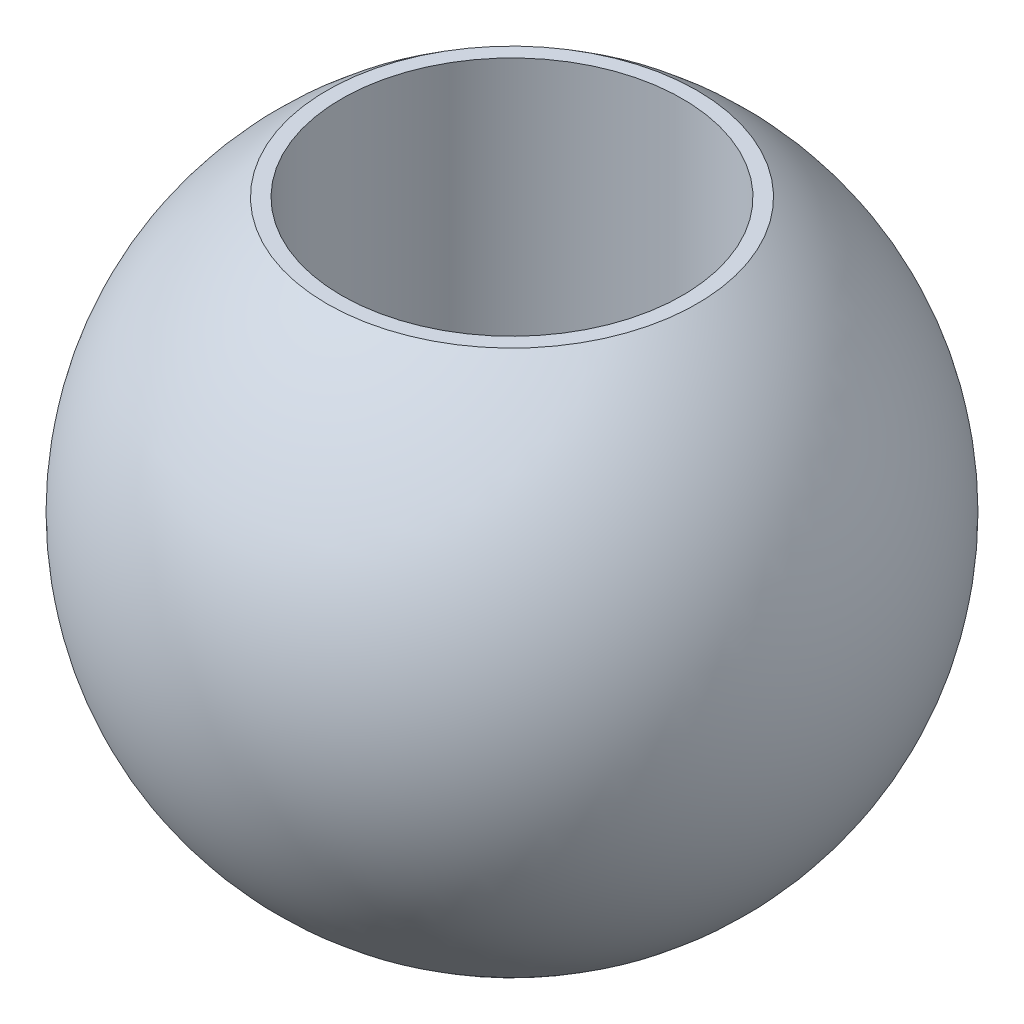
ISO-10303-21;
HEADER;
FILE_DESCRIPTION(('STEP AP214'),'2;1');
FILE_NAME('part.step','',(''),(''),'','','');
FILE_SCHEMA(('AUTOMOTIVE_DESIGN { 1 0 10303 214 1 1 1 1 }'));
ENDSEC;
DATA;
#1=APPLICATION_CONTEXT('core data for automotive mechanical design processes');
#2=APPLICATION_PROTOCOL_DEFINITION('international standard','automotive_design',2000,#1);
#3=PRODUCT_CONTEXT('',#1,'mechanical');
#4=PRODUCT('Part','Part','',(#3));
#5=PRODUCT_RELATED_PRODUCT_CATEGORY('part','',(#4));
#6=PRODUCT_DEFINITION_FORMATION('','',#4);
#7=PRODUCT_DEFINITION_CONTEXT('part definition',#1,'design');
#8=PRODUCT_DEFINITION('design','',#6,#7);
#9=PRODUCT_DEFINITION_SHAPE('','',#8);
#10=(LENGTH_UNIT() NAMED_UNIT(*) SI_UNIT(.MILLI.,.METRE.));
#11=(NAMED_UNIT(*) PLANE_ANGLE_UNIT() SI_UNIT($,.RADIAN.));
#12=(NAMED_UNIT(*) SI_UNIT($,.STERADIAN.) SOLID_ANGLE_UNIT());
#13=UNCERTAINTY_MEASURE_WITH_UNIT(LENGTH_MEASURE(1.E-05),#10,'distance_accuracy_value','');
#14=(GEOMETRIC_REPRESENTATION_CONTEXT(3) GLOBAL_UNCERTAINTY_ASSIGNED_CONTEXT((#13)) GLOBAL_UNIT_ASSIGNED_CONTEXT((#10,
#11,#12)) REPRESENTATION_CONTEXT('',''));
#15=CARTESIAN_POINT('',(0.,0.,0.));
#16=DIRECTION('',(0.,0.,1.));
#17=DIRECTION('',(1.,0.,0.));
#18=AXIS2_PLACEMENT_3D('',#15,#16,#17);
#19=CARTESIAN_POINT('',(2.9,0.,0.));
#20=DIRECTION('',(-1.,0.,0.));
#21=DIRECTION('',(0.,1.,0.));
#22=AXIS2_PLACEMENT_3D('',#19,#20,#21);
#23=SPHERICAL_SURFACE('',#22,2.9);
#24=CARTESIAN_POINT('',(2.9,0.,0.));
#25=DIRECTION('',(0.,-1.,0.));
#26=DIRECTION('',(0.,0.,-1.));
#27=AXIS2_PLACEMENT_3D('',#24,#25,#26);
#28=SPHERICAL_SURFACE('',#27,2.9);
#29=CARTESIAN_POINT('',(2.9,2.4,0.));
#30=DIRECTION('',(0.,-1.,0.));
#31=DIRECTION('',(0.,0.,-1.));
#32=AXIS2_PLACEMENT_3D('',#29,#30,#31);
#33=CIRCLE('',#32,1.62788205960997);
#34=CARTESIAN_POINT('',(2.9,2.4,-1.62788205960997));
#35=VERTEX_POINT('',#34);
#36=EDGE_CURVE('E10',#35,#35,#33,.T.);
#37=ORIENTED_EDGE('',*,*,#36,.T.);
#38=EDGE_LOOP('',(#37));
#39=FACE_BOUND('',#38,.T.);
#40=CARTESIAN_POINT('',(2.9,-2.4,0.));
#41=DIRECTION('',(0.,1.,0.));
#42=DIRECTION('',(0.,0.,1.));
#43=AXIS2_PLACEMENT_3D('',#40,#41,#42);
#44=CIRCLE('',#43,1.62788205960997);
#45=CARTESIAN_POINT('',(2.9,-2.4,1.62788205960997));
#46=VERTEX_POINT('',#45);
#47=EDGE_CURVE('E38',#46,#46,#44,.T.);
#48=ORIENTED_EDGE('',*,*,#47,.T.);
#49=EDGE_LOOP('',(#48));
#50=FACE_BOUND('',#49,.T.);
#51=ADVANCED_FACE('F32',(#39,#50),#28,.T.);
#52=CARTESIAN_POINT('',(1.27211794039003,-2.4,-5.));
#53=DIRECTION('',(0.,1.,0.));
#54=DIRECTION('',(0.,0.,1.));
#55=AXIS2_PLACEMENT_3D('',#52,#53,#54);
#56=PLANE('',#55);
#57=CARTESIAN_POINT('',(2.9,-2.4,0.));
#58=DIRECTION('',(0.,1.,0.));
#59=DIRECTION('',(0.,0.,1.));
#60=AXIS2_PLACEMENT_3D('',#57,#58,#59);
#61=CIRCLE('',#60,1.5);
#62=CARTESIAN_POINT('',(2.9,-2.4,1.5));
#63=VERTEX_POINT('',#62);
#64=EDGE_CURVE('E42',#63,#63,#61,.T.);
#65=ORIENTED_EDGE('',*,*,#64,.T.);
#66=EDGE_LOOP('',(#65));
#67=FACE_BOUND('',#66,.T.);
#68=ORIENTED_EDGE('',*,*,#47,.F.);
#69=EDGE_LOOP('',(#68));
#70=FACE_BOUND('',#69,.T.);
#71=ADVANCED_FACE('F57',(#67,#70),#56,.F.);
#72=CARTESIAN_POINT('',(1.27211794039003,2.4,-5.));
#73=DIRECTION('',(0.,-1.,0.));
#74=DIRECTION('',(0.,0.,-1.));
#75=AXIS2_PLACEMENT_3D('',#72,#73,#74);
#76=PLANE('',#75);
#77=CARTESIAN_POINT('',(2.9,2.4,0.));
#78=DIRECTION('',(0.,1.,0.));
#79=DIRECTION('',(0.,0.,1.));
#80=AXIS2_PLACEMENT_3D('',#77,#78,#79);
#81=CIRCLE('',#80,1.5);
#82=CARTESIAN_POINT('',(2.9,2.4,1.5));
#83=VERTEX_POINT('',#82);
#84=EDGE_CURVE('E46',#83,#83,#81,.T.);
#85=ORIENTED_EDGE('',*,*,#84,.F.);
#86=EDGE_LOOP('',(#85));
#87=FACE_BOUND('',#86,.T.);
#88=ORIENTED_EDGE('',*,*,#36,.F.);
#89=EDGE_LOOP('',(#88));
#90=FACE_BOUND('',#89,.T.);
#91=ADVANCED_FACE('F54',(#87,#90),#76,.F.);
#92=CARTESIAN_POINT('',(2.9,-2.4,0.));
#93=DIRECTION('',(0.,1.,0.));
#94=DIRECTION('',(0.,0.,1.));
#95=AXIS2_PLACEMENT_3D('',#92,#93,#94);
#96=CYLINDRICAL_SURFACE('',#95,1.5);
#97=ORIENTED_EDGE('',*,*,#64,.F.);
#98=EDGE_LOOP('',(#97));
#99=FACE_BOUND('',#98,.T.);
#100=ORIENTED_EDGE('',*,*,#84,.T.);
#101=EDGE_LOOP('',(#100));
#102=FACE_BOUND('',#101,.T.);
#103=ADVANCED_FACE('F52',(#99,#102),#96,.F.);
#104=CLOSED_SHELL('',(#51,#71,#91,#103));
#105=MANIFOLD_SOLID_BREP('B2',#104);
#106=ADVANCED_BREP_SHAPE_REPRESENTATION('',(#18,#105),#14);
#107=SHAPE_DEFINITION_REPRESENTATION(#9,#106);
ENDSEC;
END-ISO-10303-21;
